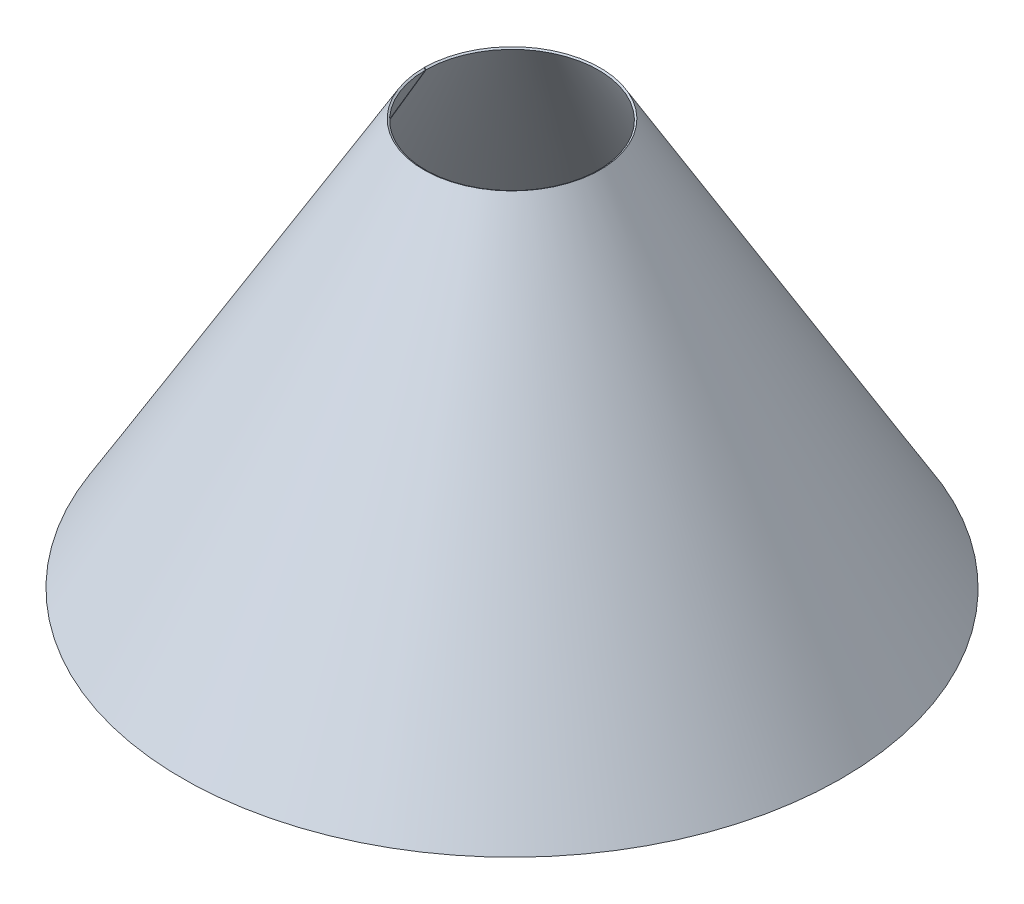
ISO-10303-21;
HEADER;
FILE_DESCRIPTION(('STEP AP214'),'2;1');
FILE_NAME('part.step','',(''),(''),'','','');
FILE_SCHEMA(('AUTOMOTIVE_DESIGN { 1 0 10303 214 1 1 1 1 }'));
ENDSEC;
DATA;
#1=APPLICATION_CONTEXT('core data for automotive mechanical design processes');
#2=APPLICATION_PROTOCOL_DEFINITION('international standard','automotive_design',2000,#1);
#3=PRODUCT_CONTEXT('',#1,'mechanical');
#4=PRODUCT('Part','Part','',(#3));
#5=PRODUCT_RELATED_PRODUCT_CATEGORY('part','',(#4));
#6=PRODUCT_DEFINITION_FORMATION('','',#4);
#7=PRODUCT_DEFINITION_CONTEXT('part definition',#1,'design');
#8=PRODUCT_DEFINITION('design','',#6,#7);
#9=PRODUCT_DEFINITION_SHAPE('','',#8);
#10=(LENGTH_UNIT() NAMED_UNIT(*) SI_UNIT(.MILLI.,.METRE.));
#11=(NAMED_UNIT(*) PLANE_ANGLE_UNIT() SI_UNIT($,.RADIAN.));
#12=(NAMED_UNIT(*) SI_UNIT($,.STERADIAN.) SOLID_ANGLE_UNIT());
#13=UNCERTAINTY_MEASURE_WITH_UNIT(LENGTH_MEASURE(1.E-05),#10,'distance_accuracy_value','');
#14=(GEOMETRIC_REPRESENTATION_CONTEXT(3) GLOBAL_UNCERTAINTY_ASSIGNED_CONTEXT((#13)) GLOBAL_UNIT_ASSIGNED_CONTEXT((#10,
#11,#12)) REPRESENTATION_CONTEXT('',''));
#15=CARTESIAN_POINT('',(0.,0.,0.));
#16=DIRECTION('',(0.,0.,1.));
#17=DIRECTION('',(1.,0.,0.));
#18=AXIS2_PLACEMENT_3D('',#15,#16,#17);
#19=CARTESIAN_POINT('',(-107.570811952193,500.638022437036,-0.938756254049901));
#20=DIRECTION('',(0.00872653549836032,0.,-0.999961923064171));
#21=DIRECTION('',(-0.510398514476826,-0.859926460051789,-0.004454180356432));
#22=AXIS2_PLACEMENT_3D('',#19,#20,#21);
#23=PLANE('',#22);
#24=DIRECTION('',(-0.859893716687153,0.51041794962834,-0.00750417877962126));
#25=VECTOR('',#24,1.);
#26=CARTESIAN_POINT('',(-404.339511479178,0.638022437035368,-3.52861745925328));
#27=LINE('',#26,#25);
#28=CARTESIAN_POINT('',(-403.264644333319,-2.22044604925031E-13,-3.51923723577857));
#29=VERTEX_POINT('',#28);
#30=CARTESIAN_POINT('',(-405.414378625037,1.27604487407074,-3.53799768272763));
#31=VERTEX_POINT('',#30);
#32=EDGE_CURVE('E75',#29,#31,#27,.T.);
#33=ORIENTED_EDGE('',*,*,#32,.F.);
#34=DIRECTION('',(-0.510398514476826,-0.859926460051789,-0.00445418035643178));
#35=VECTOR('',#34,1.);
#36=CARTESIAN_POINT('',(-1478.97276385525,-1812.3678831974,-12.9067997762771));
#37=LINE('',#36,#35);
#38=CARTESIAN_POINT('',(-106.495944806334,500.,-0.929376030575324));
#39=VERTEX_POINT('',#38);
#40=EDGE_CURVE('E204',#39,#29,#37,.T.);
#41=ORIENTED_EDGE('',*,*,#40,.F.);
#42=DIRECTION('',(-0.859893716687153,0.51041794962834,-0.00750417877962044));
#43=VECTOR('',#42,1.);
#44=CARTESIAN_POINT('',(-107.570811952193,500.638022437036,-0.938756254049798));
#45=LINE('',#44,#43);
#46=CARTESIAN_POINT('',(-108.645679098052,501.276044874071,-0.948136477524376));
#47=VERTEX_POINT('',#46);
#48=EDGE_CURVE('E166',#39,#47,#45,.T.);
#49=ORIENTED_EDGE('',*,*,#48,.T.);
#50=DIRECTION('',(-0.510398514476826,-0.859926460051789,-0.00445418035643178));
#51=VECTOR('',#50,1.);
#52=CARTESIAN_POINT('',(-1481.12249814697,-1811.09183832333,-12.9255602232262));
#53=LINE('',#52,#51);
#54=EDGE_CURVE('E203',#47,#31,#53,.T.);
#55=ORIENTED_EDGE('',*,*,#54,.T.);
#56=EDGE_LOOP('',(#33,#41,#49,#55));
#57=FACE_BOUND('',#56,.T.);
#58=ADVANCED_FACE('F155',(#57),#23,.F.);
#59=CARTESIAN_POINT('',(0.,500.638022437036,0.));
#60=DIRECTION('',(0.,1.,0.));
#61=DIRECTION('',(0.,0.,1.));
#62=AXIS2_PLACEMENT_3D('',#59,#60,#61);
#63=CONICAL_SURFACE('',#62,107.574908075065,1.03512557708564);
#64=ORIENTED_EDGE('',*,*,#48,.F.);
#65=CARTESIAN_POINT('',(0.,500.,0.));
#66=DIRECTION('',(0.,-1.,0.));
#67=DIRECTION('',(0.,0.,-1.));
#68=AXIS2_PLACEMENT_3D('',#65,#66,#67);
#69=CIRCLE('',#68,106.5);
#70=CARTESIAN_POINT('',(-106.5,500.,-4.33162234549452E-12));
#71=VERTEX_POINT('',#70);
#72=EDGE_CURVE('E229',#71,#39,#69,.F.);
#73=ORIENTED_EDGE('',*,*,#72,.F.);
#74=DIRECTION('',(-0.859926460051789,0.51041794962834,0.));
#75=VECTOR('',#74,1.);
#76=CARTESIAN_POINT('',(-107.574908075065,500.638022437036,-4.3193182234338E-12));
#77=LINE('',#76,#75);
#78=CARTESIAN_POINT('',(-108.649816150129,501.276044874071,-4.41906076497438E-12));
#79=VERTEX_POINT('',#78);
#80=EDGE_CURVE('E199',#71,#79,#77,.T.);
#81=ORIENTED_EDGE('',*,*,#80,.T.);
#82=CARTESIAN_POINT('',(0.,501.276044874071,0.));
#83=DIRECTION('',(0.,-1.,0.));
#84=DIRECTION('',(0.,0.,-1.));
#85=AXIS2_PLACEMENT_3D('',#82,#83,#84);
#86=CIRCLE('',#85,108.649816150129);
#87=EDGE_CURVE('E212',#79,#47,#86,.F.);
#88=ORIENTED_EDGE('',*,*,#87,.T.);
#89=EDGE_LOOP('',(#64,#73,#81,#88));
#90=FACE_BOUND('',#89,.T.);
#91=ADVANCED_FACE('F216',(#90),#63,.F.);
#92=CARTESIAN_POINT('',(-404.354908075051,0.638022437059349,-1.6879136771605E-11));
#93=DIRECTION('',(0.,0.,1.));
#94=DIRECTION('',(0.51041794962834,0.859926460051789,0.));
#95=AXIS2_PLACEMENT_3D('',#92,#93,#94);
#96=PLANE('',#95);
#97=ORIENTED_EDGE('',*,*,#80,.F.);
#98=DIRECTION('',(-0.51041794962834,-0.859926460051789,0.));
#99=VECTOR('',#98,1.);
#100=CARTESIAN_POINT('',(-1479.02908075065,-1812.3678831974,-6.01558255006173E-11));
#101=LINE('',#100,#99);
#102=CARTESIAN_POINT('',(-403.28,-2.22044604925031E-13,-1.64024099482726E-11));
#103=VERTEX_POINT('',#102);
#104=EDGE_CURVE('E218',#103,#71,#101,.F.);
#105=ORIENTED_EDGE('',*,*,#104,.F.);
#106=DIRECTION('',(-0.859926460051789,0.51041794962834,0.));
#107=VECTOR('',#106,1.);
#108=CARTESIAN_POINT('',(-404.354908075058,0.638022437059349,-1.6446129158176E-11));
#109=LINE('',#108,#107);
#110=CARTESIAN_POINT('',(-405.42981615013,1.27604487407074,-1.64898483677525E-11));
#111=VERTEX_POINT('',#110);
#112=EDGE_CURVE('E159',#103,#111,#109,.T.);
#113=ORIENTED_EDGE('',*,*,#112,.T.);
#114=DIRECTION('',(-0.51041794962834,-0.859926460051789,0.));
#115=VECTOR('',#114,1.);
#116=CARTESIAN_POINT('',(-1481.17889690078,-1811.09183832333,-6.02432639200972E-11));
#117=LINE('',#116,#115);
#118=EDGE_CURVE('E225',#111,#79,#117,.F.);
#119=ORIENTED_EDGE('',*,*,#118,.T.);
#120=EDGE_LOOP('',(#97,#105,#113,#119));
#121=FACE_BOUND('',#120,.T.);
#122=ADVANCED_FACE('F239',(#121),#96,.F.);
#123=CARTESIAN_POINT('',(0.,0.638022437035257,0.));
#124=DIRECTION('',(0.,1.,0.));
#125=DIRECTION('',(0.,0.,1.));
#126=AXIS2_PLACEMENT_3D('',#123,#124,#125);
#127=CONICAL_SURFACE('',#126,404.354908075058,1.03512557708564);
#128=CARTESIAN_POINT('',(0.,-2.22044604925031E-13,0.));
#129=DIRECTION('',(0.,-1.,0.));
#130=DIRECTION('',(0.,0.,-1.));
#131=AXIS2_PLACEMENT_3D('',#128,#129,#130);
#132=CIRCLE('',#131,403.28);
#133=EDGE_CURVE('E222',#29,#103,#132,.T.);
#134=ORIENTED_EDGE('',*,*,#133,.F.);
#135=ORIENTED_EDGE('',*,*,#32,.T.);
#136=CARTESIAN_POINT('',(0.,1.27604487407074,0.));
#137=DIRECTION('',(0.,-1.,0.));
#138=DIRECTION('',(0.,0.,-1.));
#139=AXIS2_PLACEMENT_3D('',#136,#137,#138);
#140=CIRCLE('',#139,405.42981615013);
#141=EDGE_CURVE('E213',#31,#111,#140,.T.);
#142=ORIENTED_EDGE('',*,*,#141,.T.);
#143=ORIENTED_EDGE('',*,*,#112,.F.);
#144=EDGE_LOOP('',(#134,#135,#142,#143));
#145=FACE_BOUND('',#144,.T.);
#146=ADVANCED_FACE('F157',(#145),#127,.T.);
#147=CARTESIAN_POINT('',(0.,-1811.09183832333,0.));
#148=DIRECTION('',(0.,-1.,0.));
#149=DIRECTION('',(0.,0.,-1.));
#150=AXIS2_PLACEMENT_3D('',#147,#148,#149);
#151=CONICAL_SURFACE('',#150,1481.17889690078,0.535670749709256);
#152=ORIENTED_EDGE('',*,*,#118,.F.);
#153=ORIENTED_EDGE('',*,*,#141,.F.);
#154=ORIENTED_EDGE('',*,*,#54,.F.);
#155=ORIENTED_EDGE('',*,*,#87,.F.);
#156=EDGE_LOOP('',(#152,#153,#154,#155));
#157=FACE_BOUND('',#156,.T.);
#158=ADVANCED_FACE('F211',(#157),#151,.T.);
#159=CARTESIAN_POINT('',(0.,-1812.3678831974,0.));
#160=DIRECTION('',(0.,-1.,0.));
#161=DIRECTION('',(0.,0.,-1.));
#162=AXIS2_PLACEMENT_3D('',#159,#160,#161);
#163=CONICAL_SURFACE('',#162,1479.02908075065,0.535670749709256);
#164=ORIENTED_EDGE('',*,*,#104,.T.);
#165=ORIENTED_EDGE('',*,*,#72,.T.);
#166=ORIENTED_EDGE('',*,*,#40,.T.);
#167=ORIENTED_EDGE('',*,*,#133,.T.);
#168=EDGE_LOOP('',(#164,#165,#166,#167));
#169=FACE_BOUND('',#168,.T.);
#170=ADVANCED_FACE('F241',(#169),#163,.F.);
#171=CLOSED_SHELL('',(#58,#91,#122,#146,#158,#170));
#172=MANIFOLD_SOLID_BREP('B10',#171);
#173=ADVANCED_BREP_SHAPE_REPRESENTATION('',(#18,#172),#14);
#174=SHAPE_DEFINITION_REPRESENTATION(#9,#173);
ENDSEC;
END-ISO-10303-21;
